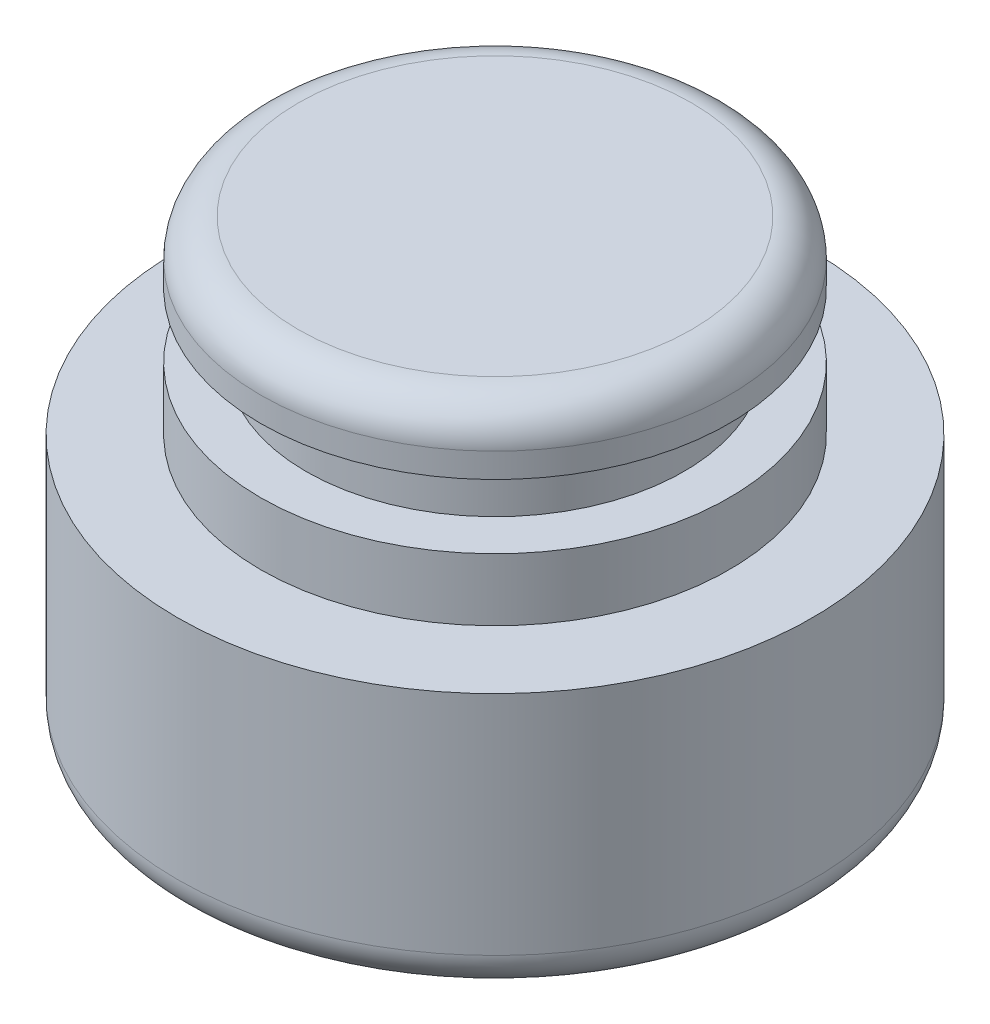
ISO-10303-21;
HEADER;
FILE_DESCRIPTION(('STEP AP214'),'2;1');
FILE_NAME('part.step','',(''),(''),'','','');
FILE_SCHEMA(('AUTOMOTIVE_DESIGN { 1 0 10303 214 1 1 1 1 }'));
ENDSEC;
DATA;
#1=APPLICATION_CONTEXT('core data for automotive mechanical design processes');
#2=APPLICATION_PROTOCOL_DEFINITION('international standard','automotive_design',2000,#1);
#3=PRODUCT_CONTEXT('',#1,'mechanical');
#4=PRODUCT('Part','Part','',(#3));
#5=PRODUCT_RELATED_PRODUCT_CATEGORY('part','',(#4));
#6=PRODUCT_DEFINITION_FORMATION('','',#4);
#7=PRODUCT_DEFINITION_CONTEXT('part definition',#1,'design');
#8=PRODUCT_DEFINITION('design','',#6,#7);
#9=PRODUCT_DEFINITION_SHAPE('','',#8);
#10=(LENGTH_UNIT() NAMED_UNIT(*) SI_UNIT(.MILLI.,.METRE.));
#11=(NAMED_UNIT(*) PLANE_ANGLE_UNIT() SI_UNIT($,.RADIAN.));
#12=(NAMED_UNIT(*) SI_UNIT($,.STERADIAN.) SOLID_ANGLE_UNIT());
#13=UNCERTAINTY_MEASURE_WITH_UNIT(LENGTH_MEASURE(1.E-05),#10,'distance_accuracy_value','');
#14=(GEOMETRIC_REPRESENTATION_CONTEXT(3) GLOBAL_UNCERTAINTY_ASSIGNED_CONTEXT((#13)) GLOBAL_UNIT_ASSIGNED_CONTEXT((#10,
#11,#12)) REPRESENTATION_CONTEXT('',''));
#15=CARTESIAN_POINT('',(0.,0.,0.));
#16=DIRECTION('',(0.,0.,1.));
#17=DIRECTION('',(1.,0.,0.));
#18=AXIS2_PLACEMENT_3D('',#15,#16,#17);
#19=CARTESIAN_POINT('',(0.,0.,0.));
#20=DIRECTION('',(0.,-1.,0.));
#21=DIRECTION('',(0.,0.,-1.));
#22=AXIS2_PLACEMENT_3D('',#19,#20,#21);
#23=PLANE('',#22);
#24=CARTESIAN_POINT('',(0.,0.,0.));
#25=DIRECTION('',(0.,-1.,0.));
#26=DIRECTION('',(0.,0.,-1.));
#27=AXIS2_PLACEMENT_3D('',#24,#25,#26);
#28=CIRCLE('',#27,7.4);
#29=CARTESIAN_POINT('',(0.,0.,-7.4));
#30=VERTEX_POINT('',#29);
#31=EDGE_CURVE('E38',#30,#30,#28,.T.);
#32=ORIENTED_EDGE('',*,*,#31,.T.);
#33=EDGE_LOOP('',(#32));
#34=FACE_BOUND('',#33,.T.);
#35=ADVANCED_FACE('F31',(#34),#23,.T.);
#36=CARTESIAN_POINT('',(0.,0.,0.));
#37=DIRECTION('',(0.,-1.,0.));
#38=DIRECTION('',(0.,0.,-1.));
#39=AXIS2_PLACEMENT_3D('',#36,#37,#38);
#40=CYLINDRICAL_SURFACE('',#39,8.4);
#41=CARTESIAN_POINT('',(0.,1.,0.));
#42=DIRECTION('',(0.,-1.,0.));
#43=DIRECTION('',(0.,0.,-1.));
#44=AXIS2_PLACEMENT_3D('',#41,#42,#43);
#45=CIRCLE('',#44,8.4);
#46=CARTESIAN_POINT('',(0.,1.,-8.4));
#47=VERTEX_POINT('',#46);
#48=EDGE_CURVE('E10',#47,#47,#45,.F.);
#49=ORIENTED_EDGE('',*,*,#48,.T.);
#50=EDGE_LOOP('',(#49));
#51=FACE_BOUND('',#50,.T.);
#52=CARTESIAN_POINT('',(0.,7.,0.));
#53=DIRECTION('',(0.,-1.,0.));
#54=DIRECTION('',(0.,0.,-1.));
#55=AXIS2_PLACEMENT_3D('',#52,#53,#54);
#56=CIRCLE('',#55,8.4);
#57=CARTESIAN_POINT('',(0.,7.,-8.4));
#58=VERTEX_POINT('',#57);
#59=EDGE_CURVE('E51',#58,#58,#56,.T.);
#60=ORIENTED_EDGE('',*,*,#59,.T.);
#61=EDGE_LOOP('',(#60));
#62=FACE_BOUND('',#61,.T.);
#63=ADVANCED_FACE('F88',(#51,#62),#40,.T.);
#64=CARTESIAN_POINT('',(6.2,7.,0.));
#65=DIRECTION('',(0.,1.,0.));
#66=DIRECTION('',(0.,0.,1.));
#67=AXIS2_PLACEMENT_3D('',#64,#65,#66);
#68=PLANE('',#67);
#69=CARTESIAN_POINT('',(0.,7.,0.));
#70=DIRECTION('',(0.,-1.,0.));
#71=DIRECTION('',(0.,0.,-1.));
#72=AXIS2_PLACEMENT_3D('',#69,#70,#71);
#73=CIRCLE('',#72,6.2);
#74=CARTESIAN_POINT('',(0.,7.,-6.2));
#75=VERTEX_POINT('',#74);
#76=EDGE_CURVE('E54',#75,#75,#73,.T.);
#77=ORIENTED_EDGE('',*,*,#76,.T.);
#78=EDGE_LOOP('',(#77));
#79=FACE_BOUND('',#78,.T.);
#80=ORIENTED_EDGE('',*,*,#59,.F.);
#81=EDGE_LOOP('',(#80));
#82=FACE_BOUND('',#81,.T.);
#83=ADVANCED_FACE('F93',(#79,#82),#68,.T.);
#84=CARTESIAN_POINT('',(0.,0.,0.));
#85=DIRECTION('',(0.,-1.,0.));
#86=DIRECTION('',(0.,0.,-1.));
#87=AXIS2_PLACEMENT_3D('',#84,#85,#86);
#88=CYLINDRICAL_SURFACE('',#87,6.2);
#89=CARTESIAN_POINT('',(0.,8.65,0.));
#90=DIRECTION('',(0.,-1.,0.));
#91=DIRECTION('',(0.,0.,-1.));
#92=AXIS2_PLACEMENT_3D('',#89,#90,#91);
#93=CIRCLE('',#92,6.2);
#94=CARTESIAN_POINT('',(0.,8.65,-6.2));
#95=VERTEX_POINT('',#94);
#96=EDGE_CURVE('E57',#95,#95,#93,.T.);
#97=ORIENTED_EDGE('',*,*,#96,.T.);
#98=EDGE_LOOP('',(#97));
#99=FACE_BOUND('',#98,.T.);
#100=ORIENTED_EDGE('',*,*,#76,.F.);
#101=EDGE_LOOP('',(#100));
#102=FACE_BOUND('',#101,.T.);
#103=ADVANCED_FACE('F159',(#99,#102),#88,.T.);
#104=CARTESIAN_POINT('',(5.,8.65,0.));
#105=DIRECTION('',(0.,1.,0.));
#106=DIRECTION('',(0.,0.,1.));
#107=AXIS2_PLACEMENT_3D('',#104,#105,#106);
#108=PLANE('',#107);
#109=CARTESIAN_POINT('',(0.,8.65,0.));
#110=DIRECTION('',(0.,-1.,0.));
#111=DIRECTION('',(0.,0.,-1.));
#112=AXIS2_PLACEMENT_3D('',#109,#110,#111);
#113=CIRCLE('',#112,5.);
#114=CARTESIAN_POINT('',(0.,8.65,-5.));
#115=VERTEX_POINT('',#114);
#116=EDGE_CURVE('E60',#115,#115,#113,.T.);
#117=ORIENTED_EDGE('',*,*,#116,.T.);
#118=EDGE_LOOP('',(#117));
#119=FACE_BOUND('',#118,.T.);
#120=ORIENTED_EDGE('',*,*,#96,.F.);
#121=EDGE_LOOP('',(#120));
#122=FACE_BOUND('',#121,.T.);
#123=ADVANCED_FACE('F149',(#119,#122),#108,.T.);
#124=CARTESIAN_POINT('',(0.,0.,0.));
#125=DIRECTION('',(0.,-1.,0.));
#126=DIRECTION('',(0.,0.,-1.));
#127=AXIS2_PLACEMENT_3D('',#124,#125,#126);
#128=CYLINDRICAL_SURFACE('',#127,5.);
#129=CARTESIAN_POINT('',(0.,10.35,0.));
#130=DIRECTION('',(0.,-1.,0.));
#131=DIRECTION('',(0.,0.,-1.));
#132=AXIS2_PLACEMENT_3D('',#129,#130,#131);
#133=CIRCLE('',#132,5.);
#134=CARTESIAN_POINT('',(0.,10.35,-5.));
#135=VERTEX_POINT('',#134);
#136=EDGE_CURVE('E63',#135,#135,#133,.T.);
#137=ORIENTED_EDGE('',*,*,#136,.T.);
#138=EDGE_LOOP('',(#137));
#139=FACE_BOUND('',#138,.T.);
#140=ORIENTED_EDGE('',*,*,#116,.F.);
#141=EDGE_LOOP('',(#140));
#142=FACE_BOUND('',#141,.T.);
#143=ADVANCED_FACE('F85',(#139,#142),#128,.T.);
#144=CARTESIAN_POINT('',(6.2,10.35,0.));
#145=DIRECTION('',(0.,-1.,0.));
#146=DIRECTION('',(0.,0.,-1.));
#147=AXIS2_PLACEMENT_3D('',#144,#145,#146);
#148=PLANE('',#147);
#149=CARTESIAN_POINT('',(0.,10.35,0.));
#150=DIRECTION('',(0.,-1.,0.));
#151=DIRECTION('',(0.,0.,-1.));
#152=AXIS2_PLACEMENT_3D('',#149,#150,#151);
#153=CIRCLE('',#152,6.2);
#154=CARTESIAN_POINT('',(0.,10.35,-6.2));
#155=VERTEX_POINT('',#154);
#156=EDGE_CURVE('E66',#155,#155,#153,.T.);
#157=ORIENTED_EDGE('',*,*,#156,.T.);
#158=EDGE_LOOP('',(#157));
#159=FACE_BOUND('',#158,.T.);
#160=ORIENTED_EDGE('',*,*,#136,.F.);
#161=EDGE_LOOP('',(#160));
#162=FACE_BOUND('',#161,.T.);
#163=ADVANCED_FACE('F70',(#159,#162),#148,.T.);
#164=CARTESIAN_POINT('',(0.,0.,0.));
#165=DIRECTION('',(0.,-1.,0.));
#166=DIRECTION('',(0.,0.,-1.));
#167=AXIS2_PLACEMENT_3D('',#164,#165,#166);
#168=CYLINDRICAL_SURFACE('',#167,6.2);
#169=CARTESIAN_POINT('',(0.,11.,0.));
#170=DIRECTION('',(0.,1.,0.));
#171=DIRECTION('',(0.,0.,1.));
#172=AXIS2_PLACEMENT_3D('',#169,#170,#171);
#173=CIRCLE('',#172,6.2);
#174=CARTESIAN_POINT('',(0.,11.,6.2));
#175=VERTEX_POINT('',#174);
#176=EDGE_CURVE('E46',#175,#175,#173,.F.);
#177=ORIENTED_EDGE('',*,*,#176,.T.);
#178=EDGE_LOOP('',(#177));
#179=FACE_BOUND('',#178,.T.);
#180=ORIENTED_EDGE('',*,*,#156,.F.);
#181=EDGE_LOOP('',(#180));
#182=FACE_BOUND('',#181,.T.);
#183=ADVANCED_FACE('F73',(#179,#182),#168,.T.);
#184=CARTESIAN_POINT('',(0.,12.,0.));
#185=DIRECTION('',(0.,1.,0.));
#186=DIRECTION('',(0.,0.,1.));
#187=AXIS2_PLACEMENT_3D('',#184,#185,#186);
#188=PLANE('',#187);
#189=CARTESIAN_POINT('',(0.,12.,0.));
#190=DIRECTION('',(0.,1.,0.));
#191=DIRECTION('',(0.,0.,1.));
#192=AXIS2_PLACEMENT_3D('',#189,#190,#191);
#193=CIRCLE('',#192,5.2);
#194=CARTESIAN_POINT('',(0.,12.,5.2));
#195=VERTEX_POINT('',#194);
#196=EDGE_CURVE('E42',#195,#195,#193,.T.);
#197=ORIENTED_EDGE('',*,*,#196,.T.);
#198=EDGE_LOOP('',(#197));
#199=FACE_BOUND('',#198,.T.);
#200=ADVANCED_FACE('F75',(#199),#188,.T.);
#201=CARTESIAN_POINT('',(0.,11.,0.));
#202=DIRECTION('',(0.,1.,0.));
#203=DIRECTION('',(0.,0.,1.));
#204=AXIS2_PLACEMENT_3D('',#201,#202,#203);
#205=TOROIDAL_SURFACE('',#204,5.2,1.);
#206=ORIENTED_EDGE('',*,*,#196,.F.);
#207=EDGE_LOOP('',(#206));
#208=FACE_BOUND('',#207,.T.);
#209=ORIENTED_EDGE('',*,*,#176,.F.);
#210=EDGE_LOOP('',(#209));
#211=FACE_BOUND('',#210,.T.);
#212=ADVANCED_FACE('F82',(#208,#211),#205,.T.);
#213=CARTESIAN_POINT('',(0.,1.,0.));
#214=DIRECTION('',(0.,-1.,0.));
#215=DIRECTION('',(0.,0.,-1.));
#216=AXIS2_PLACEMENT_3D('',#213,#214,#215);
#217=TOROIDAL_SURFACE('',#216,7.4,1.);
#218=ORIENTED_EDGE('',*,*,#48,.F.);
#219=EDGE_LOOP('',(#218));
#220=FACE_BOUND('',#219,.T.);
#221=ORIENTED_EDGE('',*,*,#31,.F.);
#222=EDGE_LOOP('',(#221));
#223=FACE_BOUND('',#222,.T.);
#224=ADVANCED_FACE('F33',(#220,#223),#217,.T.);
#225=CLOSED_SHELL('',(#35,#63,#83,#103,#123,#143,#163,#183,#200,#212,#224));
#226=MANIFOLD_SOLID_BREP('B2',#225);
#227=ADVANCED_BREP_SHAPE_REPRESENTATION('',(#18,#226),#14);
#228=SHAPE_DEFINITION_REPRESENTATION(#9,#227);
ENDSEC;
END-ISO-10303-21;
